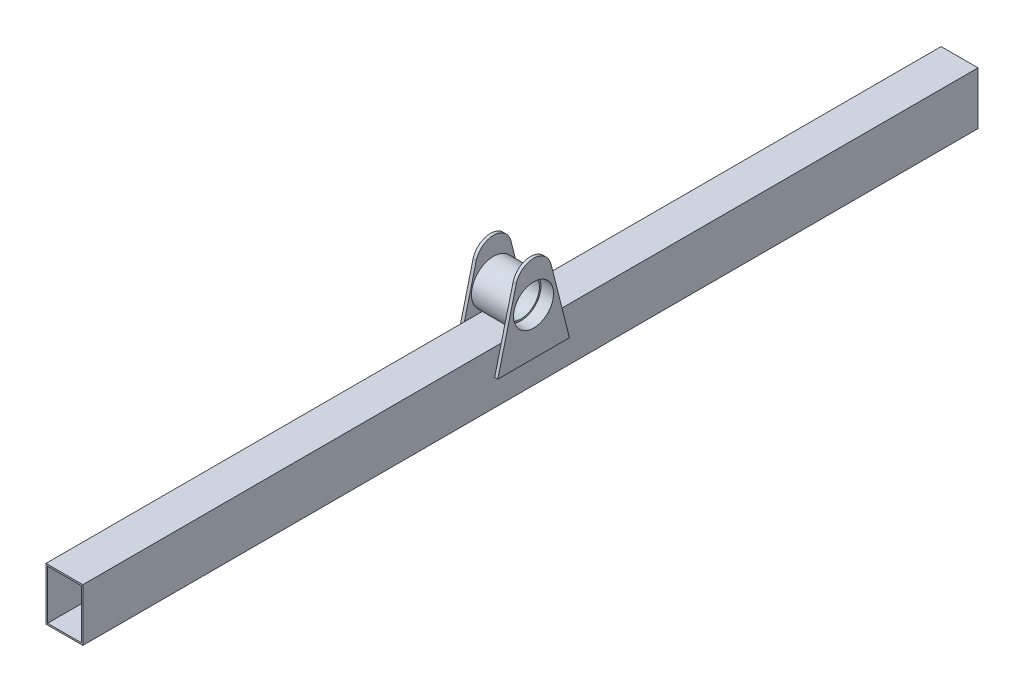
ISO-10303-21;
HEADER;
FILE_DESCRIPTION(('STEP AP214'),'2;1');
FILE_NAME('part.step','',(''),(''),'','','');
FILE_SCHEMA(('AUTOMOTIVE_DESIGN { 1 0 10303 214 1 1 1 1 }'));
ENDSEC;
DATA;
#1=APPLICATION_CONTEXT('core data for automotive mechanical design processes');
#2=APPLICATION_PROTOCOL_DEFINITION('international standard','automotive_design',2000,#1);
#3=PRODUCT_CONTEXT('',#1,'mechanical');
#4=PRODUCT('Part','Part','',(#3));
#5=PRODUCT_RELATED_PRODUCT_CATEGORY('part','',(#4));
#6=PRODUCT_DEFINITION_FORMATION('','',#4);
#7=PRODUCT_DEFINITION_CONTEXT('part definition',#1,'design');
#8=PRODUCT_DEFINITION('design','',#6,#7);
#9=PRODUCT_DEFINITION_SHAPE('','',#8);
#10=(LENGTH_UNIT() NAMED_UNIT(*) SI_UNIT(.MILLI.,.METRE.));
#11=(NAMED_UNIT(*) PLANE_ANGLE_UNIT() SI_UNIT($,.RADIAN.));
#12=(NAMED_UNIT(*) SI_UNIT($,.STERADIAN.) SOLID_ANGLE_UNIT());
#13=UNCERTAINTY_MEASURE_WITH_UNIT(LENGTH_MEASURE(1.E-05),#10,'distance_accuracy_value','');
#14=(GEOMETRIC_REPRESENTATION_CONTEXT(3) GLOBAL_UNCERTAINTY_ASSIGNED_CONTEXT((#13)) GLOBAL_UNIT_ASSIGNED_CONTEXT((#10,
#11,#12)) REPRESENTATION_CONTEXT('',''));
#15=CARTESIAN_POINT('',(0.,0.,0.));
#16=DIRECTION('',(0.,0.,1.));
#17=DIRECTION('',(1.,0.,0.));
#18=AXIS2_PLACEMENT_3D('',#15,#16,#17);
#19=CARTESIAN_POINT('',(76.89696961967,44.,35.));
#20=DIRECTION('',(-1.,0.,0.));
#21=DIRECTION('',(0.,-1.,0.));
#22=AXIS2_PLACEMENT_3D('',#19,#20,#21);
#23=CYLINDRICAL_SURFACE('',#22,17.5);
#24=CARTESIAN_POINT('',(8.50000000000001,44.,35.));
#25=DIRECTION('',(1.,0.,0.));
#26=DIRECTION('',(0.,1.,0.));
#27=AXIS2_PLACEMENT_3D('',#24,#25,#26);
#28=CIRCLE('',#27,17.5);
#29=CARTESIAN_POINT('',(8.50000000000001,61.5,35.));
#30=VERTEX_POINT('',#29);
#31=EDGE_CURVE('E256',#30,#30,#28,.T.);
#32=ORIENTED_EDGE('',*,*,#31,.T.);
#33=EDGE_LOOP('',(#32));
#34=FACE_BOUND('',#33,.T.);
#35=CARTESIAN_POINT('',(-8.50000000000001,44.,35.));
#36=DIRECTION('',(-1.,0.,0.));
#37=DIRECTION('',(0.,-1.,0.));
#38=AXIS2_PLACEMENT_3D('',#35,#36,#37);
#39=CIRCLE('',#38,17.5);
#40=CARTESIAN_POINT('',(-8.50000000000001,26.5,35.));
#41=VERTEX_POINT('',#40);
#42=EDGE_CURVE('E45',#41,#41,#39,.T.);
#43=ORIENTED_EDGE('',*,*,#42,.T.);
#44=EDGE_LOOP('',(#43));
#45=FACE_BOUND('',#44,.T.);
#46=ADVANCED_FACE('F41',(#34,#45),#23,.F.);
#47=CARTESIAN_POINT('',(-17.5,25.,460.));
#48=DIRECTION('',(0.,-1.,0.));
#49=DIRECTION('',(0.,0.,-1.));
#50=AXIS2_PLACEMENT_3D('',#47,#48,#49);
#51=PLANE('',#50);
#52=DIRECTION('',(-1.,0.,0.));
#53=VECTOR('',#52,1.);
#54=CARTESIAN_POINT('',(76.89696961967,25.,43.9442719099991));
#55=LINE('',#54,#53);
#56=CARTESIAN_POINT('',(-17.5,25.,43.9442719099991));
#57=VERTEX_POINT('',#56);
#58=CARTESIAN_POINT('',(17.5,25.,43.9442719099991));
#59=VERTEX_POINT('',#58);
#60=EDGE_CURVE('E68',#57,#59,#55,.F.);
#61=ORIENTED_EDGE('',*,*,#60,.F.);
#62=DIRECTION('',(0.,0.,-1.));
#63=VECTOR('',#62,1.);
#64=CARTESIAN_POINT('',(-17.5,25.,460.));
#65=LINE('',#64,#63);
#66=CARTESIAN_POINT('',(-17.5,25.,62.7038895343666));
#67=VERTEX_POINT('',#66);
#68=EDGE_CURVE('E424',#67,#57,#65,.T.);
#69=ORIENTED_EDGE('',*,*,#68,.F.);
#70=CARTESIAN_POINT('',(-17.5,25.,460.));
#71=VERTEX_POINT('',#70);
#72=EDGE_CURVE('E420',#71,#67,#65,.T.);
#73=ORIENTED_EDGE('',*,*,#72,.F.);
#74=DIRECTION('',(-1.,0.,0.));
#75=VECTOR('',#74,1.);
#76=CARTESIAN_POINT('',(-17.5,25.,460.));
#77=LINE('',#76,#75);
#78=CARTESIAN_POINT('',(17.5,25.,460.));
#79=VERTEX_POINT('',#78);
#80=EDGE_CURVE('E404',#79,#71,#77,.T.);
#81=ORIENTED_EDGE('',*,*,#80,.F.);
#82=DIRECTION('',(0.,0.,-1.));
#83=VECTOR('',#82,1.);
#84=CARTESIAN_POINT('',(17.5,25.,460.));
#85=LINE('',#84,#83);
#86=CARTESIAN_POINT('',(17.5,25.,62.7038895343666));
#87=VERTEX_POINT('',#86);
#88=EDGE_CURVE('E426',#79,#87,#85,.T.);
#89=ORIENTED_EDGE('',*,*,#88,.T.);
#90=EDGE_CURVE('E429',#87,#59,#85,.T.);
#91=ORIENTED_EDGE('',*,*,#90,.T.);
#92=EDGE_LOOP('',(#61,#69,#73,#81,#89,#91));
#93=FACE_BOUND('',#92,.T.);
#94=ADVANCED_FACE('F462',(#93),#51,.F.);
#95=DIRECTION('',(-1.,0.,0.));
#96=VECTOR('',#95,1.);
#97=CARTESIAN_POINT('',(76.89696961967,25.,26.0557280900009));
#98=LINE('',#97,#96);
#99=CARTESIAN_POINT('',(17.5,25.,26.0557280900009));
#100=VERTEX_POINT('',#99);
#101=CARTESIAN_POINT('',(-17.5,25.,26.0557280900009));
#102=VERTEX_POINT('',#101);
#103=EDGE_CURVE('E273',#100,#102,#98,.T.);
#104=ORIENTED_EDGE('',*,*,#103,.F.);
#105=CARTESIAN_POINT('',(17.5,25.,7.29611046563342));
#106=VERTEX_POINT('',#105);
#107=EDGE_CURVE('E430',#100,#106,#85,.T.);
#108=ORIENTED_EDGE('',*,*,#107,.T.);
#109=CARTESIAN_POINT('',(17.5,25.,-390.));
#110=VERTEX_POINT('',#109);
#111=EDGE_CURVE('E423',#106,#110,#85,.T.);
#112=ORIENTED_EDGE('',*,*,#111,.T.);
#113=DIRECTION('',(-1.,0.,0.));
#114=VECTOR('',#113,1.);
#115=CARTESIAN_POINT('',(-17.5,25.,-390.));
#116=LINE('',#115,#114);
#117=CARTESIAN_POINT('',(-17.5,25.,-390.));
#118=VERTEX_POINT('',#117);
#119=EDGE_CURVE('E236',#110,#118,#116,.T.);
#120=ORIENTED_EDGE('',*,*,#119,.T.);
#121=CARTESIAN_POINT('',(-17.5,25.,7.29611046563346));
#122=VERTEX_POINT('',#121);
#123=EDGE_CURVE('E419',#122,#118,#65,.T.);
#124=ORIENTED_EDGE('',*,*,#123,.F.);
#125=EDGE_CURVE('E425',#102,#122,#65,.T.);
#126=ORIENTED_EDGE('',*,*,#125,.F.);
#127=EDGE_LOOP('',(#104,#108,#112,#120,#124,#126));
#128=FACE_BOUND('',#127,.T.);
#129=ADVANCED_FACE('F466',(#128),#51,.F.);
#130=CARTESIAN_POINT('',(-16.,23.5,460.));
#131=DIRECTION('',(0.,-1.,0.));
#132=DIRECTION('',(0.,0.,-1.));
#133=AXIS2_PLACEMENT_3D('',#130,#131,#132);
#134=PLANE('',#133);
#135=DIRECTION('',(0.,0.,-1.));
#136=VECTOR('',#135,1.);
#137=CARTESIAN_POINT('',(-16.,23.5,460.));
#138=LINE('',#137,#136);
#139=CARTESIAN_POINT('',(-16.,23.5,460.));
#140=VERTEX_POINT('',#139);
#141=CARTESIAN_POINT('',(-16.,23.5,39.5552167895721));
#142=VERTEX_POINT('',#141);
#143=EDGE_CURVE('E208',#140,#142,#138,.T.);
#144=ORIENTED_EDGE('',*,*,#143,.T.);
#145=DIRECTION('',(-1.,0.,0.));
#146=VECTOR('',#145,1.);
#147=CARTESIAN_POINT('',(76.89696961967,23.5,39.5552167895721));
#148=LINE('',#147,#146);
#149=CARTESIAN_POINT('',(16.,23.5,39.5552167895721));
#150=VERTEX_POINT('',#149);
#151=EDGE_CURVE('E60',#142,#150,#148,.F.);
#152=ORIENTED_EDGE('',*,*,#151,.T.);
#153=DIRECTION('',(0.,0.,-1.));
#154=VECTOR('',#153,1.);
#155=CARTESIAN_POINT('',(16.,23.5,460.));
#156=LINE('',#155,#154);
#157=CARTESIAN_POINT('',(16.,23.5,460.));
#158=VERTEX_POINT('',#157);
#159=EDGE_CURVE('E207',#158,#150,#156,.T.);
#160=ORIENTED_EDGE('',*,*,#159,.F.);
#161=DIRECTION('',(-1.,0.,0.));
#162=VECTOR('',#161,1.);
#163=CARTESIAN_POINT('',(-16.,23.5,460.));
#164=LINE('',#163,#162);
#165=EDGE_CURVE('E380',#158,#140,#164,.T.);
#166=ORIENTED_EDGE('',*,*,#165,.T.);
#167=EDGE_LOOP('',(#144,#152,#160,#166));
#168=FACE_BOUND('',#167,.T.);
#169=ADVANCED_FACE('F530',(#168),#134,.T.);
#170=CARTESIAN_POINT('',(16.,23.5,30.4447832104279));
#171=VERTEX_POINT('',#170);
#172=CARTESIAN_POINT('',(16.,23.5,-390.));
#173=VERTEX_POINT('',#172);
#174=EDGE_CURVE('E195',#171,#173,#156,.T.);
#175=ORIENTED_EDGE('',*,*,#174,.F.);
#176=DIRECTION('',(-1.,0.,0.));
#177=VECTOR('',#176,1.);
#178=CARTESIAN_POINT('',(76.89696961967,23.5,30.4447832104279));
#179=LINE('',#178,#177);
#180=CARTESIAN_POINT('',(-16.,23.5,30.4447832104279));
#181=VERTEX_POINT('',#180);
#182=EDGE_CURVE('E266',#171,#181,#179,.T.);
#183=ORIENTED_EDGE('',*,*,#182,.T.);
#184=CARTESIAN_POINT('',(-16.,23.5,-390.));
#185=VERTEX_POINT('',#184);
#186=EDGE_CURVE('E214',#181,#185,#138,.T.);
#187=ORIENTED_EDGE('',*,*,#186,.T.);
#188=DIRECTION('',(-1.,0.,0.));
#189=VECTOR('',#188,1.);
#190=CARTESIAN_POINT('',(-16.,23.5,-390.));
#191=LINE('',#190,#189);
#192=EDGE_CURVE('E211',#173,#185,#191,.T.);
#193=ORIENTED_EDGE('',*,*,#192,.F.);
#194=EDGE_LOOP('',(#175,#183,#187,#193));
#195=FACE_BOUND('',#194,.T.);
#196=ADVANCED_FACE('F212',(#195),#134,.T.);
#197=CARTESIAN_POINT('',(-17.5,25.,460.));
#198=DIRECTION('',(1.,0.,0.));
#199=DIRECTION('',(0.,1.,0.));
#200=AXIS2_PLACEMENT_3D('',#197,#198,#199);
#201=PLANE('',#200);
#202=DIRECTION('',(0.,-0.969720199688775,-0.244218619919864));
#203=VECTOR('',#202,1.);
#204=CARTESIAN_POINT('',(-17.5,0.,1.00000000000003));
#205=LINE('',#204,#203);
#206=CARTESIAN_POINT('',(-17.5,0.,1.00000000000003));
#207=VERTEX_POINT('',#206);
#208=EDGE_CURVE('E51',#122,#207,#205,.T.);
#209=ORIENTED_EDGE('',*,*,#208,.F.);
#210=ORIENTED_EDGE('',*,*,#123,.T.);
#211=DIRECTION('',(0.,-1.,0.));
#212=VECTOR('',#211,1.);
#213=CARTESIAN_POINT('',(-17.5,25.,-390.));
#214=LINE('',#213,#212);
#215=CARTESIAN_POINT('',(-17.5,-25.,-390.));
#216=VERTEX_POINT('',#215);
#217=EDGE_CURVE('E240',#118,#216,#214,.T.);
#218=ORIENTED_EDGE('',*,*,#217,.T.);
#219=DIRECTION('',(0.,0.,-1.));
#220=VECTOR('',#219,1.);
#221=CARTESIAN_POINT('',(-17.5,-25.,460.));
#222=LINE('',#221,#220);
#223=CARTESIAN_POINT('',(-17.5,-25.,460.));
#224=VERTEX_POINT('',#223);
#225=EDGE_CURVE('E416',#224,#216,#222,.T.);
#226=ORIENTED_EDGE('',*,*,#225,.F.);
#227=DIRECTION('',(0.,-1.,0.));
#228=VECTOR('',#227,1.);
#229=CARTESIAN_POINT('',(-17.5,25.,460.));
#230=LINE('',#229,#228);
#231=EDGE_CURVE('E407',#71,#224,#230,.T.);
#232=ORIENTED_EDGE('',*,*,#231,.F.);
#233=ORIENTED_EDGE('',*,*,#72,.T.);
#234=DIRECTION('',(0.,0.969720199688775,-0.244218619919864));
#235=VECTOR('',#234,1.);
#236=CARTESIAN_POINT('',(-17.5,25.,62.7038895343666));
#237=LINE('',#236,#235);
#238=CARTESIAN_POINT('',(-17.5,0.,69.));
#239=VERTEX_POINT('',#238);
#240=EDGE_CURVE('E351',#239,#67,#237,.T.);
#241=ORIENTED_EDGE('',*,*,#240,.F.);
#242=DIRECTION('',(0.,0.,1.));
#243=VECTOR('',#242,1.);
#244=CARTESIAN_POINT('',(-17.5,0.,1.00000000000003));
#245=LINE('',#244,#243);
#246=EDGE_CURVE('E331',#207,#239,#245,.T.);
#247=ORIENTED_EDGE('',*,*,#246,.F.);
#248=EDGE_LOOP('',(#209,#210,#218,#226,#232,#233,#241,#247));
#249=FACE_BOUND('',#248,.T.);
#250=ADVANCED_FACE('F650',(#249),#201,.F.);
#251=CARTESIAN_POINT('',(0.,0.,460.));
#252=DIRECTION('',(0.,0.,1.));
#253=DIRECTION('',(1.,0.,0.));
#254=AXIS2_PLACEMENT_3D('',#251,#252,#253);
#255=PLANE('',#254);
#256=DIRECTION('',(0.,1.,0.));
#257=VECTOR('',#256,1.);
#258=CARTESIAN_POINT('',(17.5,25.,460.));
#259=LINE('',#258,#257);
#260=CARTESIAN_POINT('',(17.5,-25.,460.));
#261=VERTEX_POINT('',#260);
#262=EDGE_CURVE('E400',#261,#79,#259,.T.);
#263=ORIENTED_EDGE('',*,*,#262,.T.);
#264=ORIENTED_EDGE('',*,*,#80,.T.);
#265=ORIENTED_EDGE('',*,*,#231,.T.);
#266=DIRECTION('',(1.,0.,0.));
#267=VECTOR('',#266,1.);
#268=CARTESIAN_POINT('',(-17.5,-25.,460.));
#269=LINE('',#268,#267);
#270=EDGE_CURVE('E410',#224,#261,#269,.T.);
#271=ORIENTED_EDGE('',*,*,#270,.T.);
#272=EDGE_LOOP('',(#263,#264,#265,#271));
#273=FACE_BOUND('',#272,.T.);
#274=ORIENTED_EDGE('',*,*,#165,.F.);
#275=DIRECTION('',(0.,1.,0.));
#276=VECTOR('',#275,1.);
#277=CARTESIAN_POINT('',(16.,23.5,460.));
#278=LINE('',#277,#276);
#279=CARTESIAN_POINT('',(16.,-23.5,460.));
#280=VERTEX_POINT('',#279);
#281=EDGE_CURVE('E377',#280,#158,#278,.T.);
#282=ORIENTED_EDGE('',*,*,#281,.F.);
#283=DIRECTION('',(1.,0.,0.));
#284=VECTOR('',#283,1.);
#285=CARTESIAN_POINT('',(-16.,-23.5,460.));
#286=LINE('',#285,#284);
#287=CARTESIAN_POINT('',(-16.,-23.5,460.));
#288=VERTEX_POINT('',#287);
#289=EDGE_CURVE('E387',#288,#280,#286,.T.);
#290=ORIENTED_EDGE('',*,*,#289,.F.);
#291=DIRECTION('',(0.,-1.,0.));
#292=VECTOR('',#291,1.);
#293=CARTESIAN_POINT('',(-16.,23.5,460.));
#294=LINE('',#293,#292);
#295=EDGE_CURVE('E383',#140,#288,#294,.T.);
#296=ORIENTED_EDGE('',*,*,#295,.F.);
#297=EDGE_LOOP('',(#274,#282,#290,#296));
#298=FACE_BOUND('',#297,.T.);
#299=ADVANCED_FACE('F646',(#273,#298),#255,.T.);
#300=CARTESIAN_POINT('',(17.5,25.,460.));
#301=DIRECTION('',(-1.,0.,0.));
#302=DIRECTION('',(0.,-1.,0.));
#303=AXIS2_PLACEMENT_3D('',#300,#301,#302);
#304=PLANE('',#303);
#305=DIRECTION('',(0.,0.,1.));
#306=VECTOR('',#305,1.);
#307=CARTESIAN_POINT('',(17.5,0.,1.00000000000003));
#308=LINE('',#307,#306);
#309=CARTESIAN_POINT('',(17.5,0.,1.00000000000003));
#310=VERTEX_POINT('',#309);
#311=CARTESIAN_POINT('',(17.5,0.,69.));
#312=VERTEX_POINT('',#311);
#313=EDGE_CURVE('E282',#310,#312,#308,.T.);
#314=ORIENTED_EDGE('',*,*,#313,.T.);
#315=DIRECTION('',(0.,0.969720199688775,-0.244218619919864));
#316=VECTOR('',#315,1.);
#317=CARTESIAN_POINT('',(17.5,0.,69.));
#318=LINE('',#317,#316);
#319=EDGE_CURVE('E288',#312,#87,#318,.T.);
#320=ORIENTED_EDGE('',*,*,#319,.T.);
#321=ORIENTED_EDGE('',*,*,#88,.F.);
#322=ORIENTED_EDGE('',*,*,#262,.F.);
#323=DIRECTION('',(0.,0.,-1.));
#324=VECTOR('',#323,1.);
#325=CARTESIAN_POINT('',(17.5,-25.,460.));
#326=LINE('',#325,#324);
#327=CARTESIAN_POINT('',(17.5,-25.,-390.));
#328=VERTEX_POINT('',#327);
#329=EDGE_CURVE('E413',#261,#328,#326,.T.);
#330=ORIENTED_EDGE('',*,*,#329,.T.);
#331=DIRECTION('',(0.,1.,0.));
#332=VECTOR('',#331,1.);
#333=CARTESIAN_POINT('',(17.5,25.,-390.));
#334=LINE('',#333,#332);
#335=EDGE_CURVE('E232',#328,#110,#334,.T.);
#336=ORIENTED_EDGE('',*,*,#335,.T.);
#337=ORIENTED_EDGE('',*,*,#111,.F.);
#338=DIRECTION('',(0.,-0.969720199688775,-0.244218619919864));
#339=VECTOR('',#338,1.);
#340=CARTESIAN_POINT('',(17.5,25.,7.29611046563342));
#341=LINE('',#340,#339);
#342=EDGE_CURVE('E11',#106,#310,#341,.T.);
#343=ORIENTED_EDGE('',*,*,#342,.T.);
#344=EDGE_LOOP('',(#314,#320,#321,#322,#330,#336,#337,#343));
#345=FACE_BOUND('',#344,.T.);
#346=ADVANCED_FACE('F43',(#345),#304,.F.);
#347=CARTESIAN_POINT('',(-17.5,-25.,460.));
#348=DIRECTION('',(0.,1.,0.));
#349=DIRECTION('',(0.,0.,1.));
#350=AXIS2_PLACEMENT_3D('',#347,#348,#349);
#351=PLANE('',#350);
#352=ORIENTED_EDGE('',*,*,#225,.T.);
#353=DIRECTION('',(1.,0.,0.));
#354=VECTOR('',#353,1.);
#355=CARTESIAN_POINT('',(-17.5,-25.,-390.));
#356=LINE('',#355,#354);
#357=EDGE_CURVE('E244',#216,#328,#356,.T.);
#358=ORIENTED_EDGE('',*,*,#357,.T.);
#359=ORIENTED_EDGE('',*,*,#329,.F.);
#360=ORIENTED_EDGE('',*,*,#270,.F.);
#361=EDGE_LOOP('',(#352,#358,#359,#360));
#362=FACE_BOUND('',#361,.T.);
#363=ADVANCED_FACE('F664',(#362),#351,.F.);
#364=CARTESIAN_POINT('',(16.,23.5,460.));
#365=DIRECTION('',(-1.,0.,0.));
#366=DIRECTION('',(0.,-1.,0.));
#367=AXIS2_PLACEMENT_3D('',#364,#365,#366);
#368=PLANE('',#367);
#369=ORIENTED_EDGE('',*,*,#159,.T.);
#370=CARTESIAN_POINT('',(16.,44.,35.));
#371=DIRECTION('',(-1.,0.,0.));
#372=DIRECTION('',(0.,-1.,0.));
#373=AXIS2_PLACEMENT_3D('',#370,#371,#372);
#374=CIRCLE('',#373,21.);
#375=EDGE_CURVE('E203',#150,#171,#374,.F.);
#376=ORIENTED_EDGE('',*,*,#375,.T.);
#377=ORIENTED_EDGE('',*,*,#174,.T.);
#378=DIRECTION('',(0.,1.,0.));
#379=VECTOR('',#378,1.);
#380=CARTESIAN_POINT('',(16.,23.5,-390.));
#381=LINE('',#380,#379);
#382=CARTESIAN_POINT('',(16.,-23.5,-390.));
#383=VERTEX_POINT('',#382);
#384=EDGE_CURVE('E201',#383,#173,#381,.T.);
#385=ORIENTED_EDGE('',*,*,#384,.F.);
#386=DIRECTION('',(0.,0.,-1.));
#387=VECTOR('',#386,1.);
#388=CARTESIAN_POINT('',(16.,-23.5,460.));
#389=LINE('',#388,#387);
#390=EDGE_CURVE('E390',#280,#383,#389,.T.);
#391=ORIENTED_EDGE('',*,*,#390,.F.);
#392=ORIENTED_EDGE('',*,*,#281,.T.);
#393=EDGE_LOOP('',(#369,#376,#377,#385,#391,#392));
#394=FACE_BOUND('',#393,.T.);
#395=ADVANCED_FACE('F198',(#394),#368,.T.);
#396=CARTESIAN_POINT('',(-16.,23.5,460.));
#397=DIRECTION('',(1.,0.,0.));
#398=DIRECTION('',(0.,1.,0.));
#399=AXIS2_PLACEMENT_3D('',#396,#397,#398);
#400=PLANE('',#399);
#401=ORIENTED_EDGE('',*,*,#186,.F.);
#402=CARTESIAN_POINT('',(-16.,44.,35.));
#403=DIRECTION('',(1.,0.,0.));
#404=DIRECTION('',(0.,1.,0.));
#405=AXIS2_PLACEMENT_3D('',#402,#403,#404);
#406=CIRCLE('',#405,21.);
#407=EDGE_CURVE('E260',#181,#142,#406,.F.);
#408=ORIENTED_EDGE('',*,*,#407,.T.);
#409=ORIENTED_EDGE('',*,*,#143,.F.);
#410=ORIENTED_EDGE('',*,*,#295,.T.);
#411=DIRECTION('',(0.,0.,-1.));
#412=VECTOR('',#411,1.);
#413=CARTESIAN_POINT('',(-16.,-23.5,460.));
#414=LINE('',#413,#412);
#415=CARTESIAN_POINT('',(-16.,-23.5,-390.));
#416=VERTEX_POINT('',#415);
#417=EDGE_CURVE('E393',#288,#416,#414,.T.);
#418=ORIENTED_EDGE('',*,*,#417,.T.);
#419=DIRECTION('',(0.,-1.,0.));
#420=VECTOR('',#419,1.);
#421=CARTESIAN_POINT('',(-16.,23.5,-390.));
#422=LINE('',#421,#420);
#423=EDGE_CURVE('E219',#185,#416,#422,.T.);
#424=ORIENTED_EDGE('',*,*,#423,.F.);
#425=EDGE_LOOP('',(#401,#408,#409,#410,#418,#424));
#426=FACE_BOUND('',#425,.T.);
#427=ADVANCED_FACE('F678',(#426),#400,.T.);
#428=CARTESIAN_POINT('',(-16.,-23.5,460.));
#429=DIRECTION('',(0.,1.,0.));
#430=DIRECTION('',(0.,0.,1.));
#431=AXIS2_PLACEMENT_3D('',#428,#429,#430);
#432=PLANE('',#431);
#433=ORIENTED_EDGE('',*,*,#390,.T.);
#434=DIRECTION('',(1.,0.,0.));
#435=VECTOR('',#434,1.);
#436=CARTESIAN_POINT('',(-16.,-23.5,-390.));
#437=LINE('',#436,#435);
#438=EDGE_CURVE('E224',#416,#383,#437,.T.);
#439=ORIENTED_EDGE('',*,*,#438,.F.);
#440=ORIENTED_EDGE('',*,*,#417,.F.);
#441=ORIENTED_EDGE('',*,*,#289,.T.);
#442=EDGE_LOOP('',(#433,#439,#440,#441));
#443=FACE_BOUND('',#442,.T.);
#444=ADVANCED_FACE('F638',(#443),#432,.T.);
#445=CARTESIAN_POINT('',(-20.5,0.,1.00000000000003));
#446=DIRECTION('',(0.,1.,0.));
#447=DIRECTION('',(-1.,0.,0.));
#448=AXIS2_PLACEMENT_3D('',#445,#446,#447);
#449=PLANE('',#448);
#450=ORIENTED_EDGE('',*,*,#246,.T.);
#451=DIRECTION('',(1.,0.,0.));
#452=VECTOR('',#451,1.);
#453=CARTESIAN_POINT('',(-20.5,0.,69.));
#454=LINE('',#453,#452);
#455=CARTESIAN_POINT('',(-20.5,0.,69.));
#456=VERTEX_POINT('',#455);
#457=EDGE_CURVE('E373',#456,#239,#454,.T.);
#458=ORIENTED_EDGE('',*,*,#457,.F.);
#459=DIRECTION('',(0.,0.,1.));
#460=VECTOR('',#459,1.);
#461=CARTESIAN_POINT('',(-20.5,0.,1.00000000000003));
#462=LINE('',#461,#460);
#463=CARTESIAN_POINT('',(-20.5,0.,1.00000000000003));
#464=VERTEX_POINT('',#463);
#465=EDGE_CURVE('E332',#464,#456,#462,.T.);
#466=ORIENTED_EDGE('',*,*,#465,.F.);
#467=DIRECTION('',(1.,0.,0.));
#468=VECTOR('',#467,1.);
#469=CARTESIAN_POINT('',(-20.5,0.,1.00000000000003));
#470=LINE('',#469,#468);
#471=EDGE_CURVE('E346',#464,#207,#470,.T.);
#472=ORIENTED_EDGE('',*,*,#471,.T.);
#473=EDGE_LOOP('',(#450,#458,#466,#472));
#474=FACE_BOUND('',#473,.T.);
#475=ADVANCED_FACE('F627',(#474),#449,.F.);
#476=CARTESIAN_POINT('',(-20.5,25.,62.7038895343666));
#477=DIRECTION('',(0.,-0.244218619919864,-0.969720199688775));
#478=DIRECTION('',(0.,0.969720199688775,-0.244218619919864));
#479=AXIS2_PLACEMENT_3D('',#476,#477,#478);
#480=PLANE('',#479);
#481=ORIENTED_EDGE('',*,*,#240,.T.);
#482=CARTESIAN_POINT('',(-17.5,69.4873449867254,51.5));
#483=VERTEX_POINT('',#482);
#484=EDGE_CURVE('E350',#67,#483,#237,.T.);
#485=ORIENTED_EDGE('',*,*,#484,.T.);
#486=DIRECTION('',(1.,0.,0.));
#487=VECTOR('',#486,1.);
#488=CARTESIAN_POINT('',(-20.5,69.4873449867254,51.5));
#489=LINE('',#488,#487);
#490=CARTESIAN_POINT('',(-20.5,69.4873449867254,51.5));
#491=VERTEX_POINT('',#490);
#492=EDGE_CURVE('E369',#491,#483,#489,.T.);
#493=ORIENTED_EDGE('',*,*,#492,.F.);
#494=DIRECTION('',(0.,0.969720199688775,-0.244218619919864));
#495=VECTOR('',#494,1.);
#496=CARTESIAN_POINT('',(-20.5,0.,69.));
#497=LINE('',#496,#495);
#498=EDGE_CURVE('E336',#456,#491,#497,.T.);
#499=ORIENTED_EDGE('',*,*,#498,.F.);
#500=ORIENTED_EDGE('',*,*,#457,.T.);
#501=EDGE_LOOP('',(#481,#485,#493,#499,#500));
#502=FACE_BOUND('',#501,.T.);
#503=ADVANCED_FACE('F617',(#502),#480,.F.);
#504=CARTESIAN_POINT('',(-20.5,65.3319120794074,35.));
#505=DIRECTION('',(1.,0.,0.));
#506=DIRECTION('',(0.,1.,0.));
#507=AXIS2_PLACEMENT_3D('',#504,#505,#506);
#508=CYLINDRICAL_SURFACE('',#507,17.0152173846596);
#509=CARTESIAN_POINT('',(-17.5,65.3319120794074,35.));
#510=DIRECTION('',(-1.,0.,0.));
#511=DIRECTION('',(0.,1.,0.));
#512=AXIS2_PLACEMENT_3D('',#509,#510,#511);
#513=CIRCLE('',#512,17.0152173846596);
#514=CARTESIAN_POINT('',(-17.5,69.4873449867254,18.5));
#515=VERTEX_POINT('',#514);
#516=EDGE_CURVE('E355',#483,#515,#513,.T.);
#517=ORIENTED_EDGE('',*,*,#516,.T.);
#518=DIRECTION('',(1.,0.,0.));
#519=VECTOR('',#518,1.);
#520=CARTESIAN_POINT('',(-20.5,69.4873449867254,18.5));
#521=LINE('',#520,#519);
#522=CARTESIAN_POINT('',(-20.5,69.4873449867254,18.5));
#523=VERTEX_POINT('',#522);
#524=EDGE_CURVE('E365',#523,#515,#521,.T.);
#525=ORIENTED_EDGE('',*,*,#524,.F.);
#526=CARTESIAN_POINT('',(-20.5,65.3319120794074,35.));
#527=DIRECTION('',(-1.,0.,0.));
#528=DIRECTION('',(0.,1.,0.));
#529=AXIS2_PLACEMENT_3D('',#526,#527,#528);
#530=CIRCLE('',#529,17.0152173846596);
#531=EDGE_CURVE('E340',#491,#523,#530,.T.);
#532=ORIENTED_EDGE('',*,*,#531,.F.);
#533=ORIENTED_EDGE('',*,*,#492,.T.);
#534=EDGE_LOOP('',(#517,#525,#532,#533));
#535=FACE_BOUND('',#534,.T.);
#536=ADVANCED_FACE('F606',(#535),#508,.T.);
#537=CARTESIAN_POINT('',(-20.5,0.,1.00000000000003));
#538=DIRECTION('',(0.,-0.244218619919864,0.969720199688775));
#539=DIRECTION('',(0.,-0.969720199688775,-0.244218619919864));
#540=AXIS2_PLACEMENT_3D('',#537,#538,#539);
#541=PLANE('',#540);
#542=EDGE_CURVE('E337',#515,#122,#205,.T.);
#543=ORIENTED_EDGE('',*,*,#542,.T.);
#544=ORIENTED_EDGE('',*,*,#208,.T.);
#545=ORIENTED_EDGE('',*,*,#471,.F.);
#546=DIRECTION('',(0.,-0.969720199688775,-0.244218619919864));
#547=VECTOR('',#546,1.);
#548=CARTESIAN_POINT('',(-20.5,25.,7.29611046563342));
#549=LINE('',#548,#547);
#550=EDGE_CURVE('E343',#523,#464,#549,.T.);
#551=ORIENTED_EDGE('',*,*,#550,.F.);
#552=ORIENTED_EDGE('',*,*,#524,.T.);
#553=EDGE_LOOP('',(#543,#544,#545,#551,#552));
#554=FACE_BOUND('',#553,.T.);
#555=ADVANCED_FACE('F596',(#554),#541,.F.);
#556=CARTESIAN_POINT('',(-20.5,65.3319120794074,35.));
#557=DIRECTION('',(1.,0.,0.));
#558=DIRECTION('',(0.,1.,0.));
#559=AXIS2_PLACEMENT_3D('',#556,#557,#558);
#560=PLANE('',#559);
#561=CARTESIAN_POINT('',(-20.5,44.,35.));
#562=DIRECTION('',(-1.,0.,0.));
#563=DIRECTION('',(0.,-1.,0.));
#564=AXIS2_PLACEMENT_3D('',#561,#562,#563);
#565=CIRCLE('',#564,19.);
#566=CARTESIAN_POINT('',(-20.5,25.,35.));
#567=VERTEX_POINT('',#566);
#568=EDGE_CURVE('E327',#567,#567,#565,.T.);
#569=ORIENTED_EDGE('',*,*,#568,.F.);
#570=EDGE_LOOP('',(#569));
#571=FACE_BOUND('',#570,.T.);
#572=ORIENTED_EDGE('',*,*,#465,.T.);
#573=ORIENTED_EDGE('',*,*,#498,.T.);
#574=ORIENTED_EDGE('',*,*,#531,.T.);
#575=ORIENTED_EDGE('',*,*,#550,.T.);
#576=EDGE_LOOP('',(#572,#573,#574,#575));
#577=FACE_BOUND('',#576,.T.);
#578=ADVANCED_FACE('F522',(#571,#577),#560,.F.);
#579=CARTESIAN_POINT('',(-17.5,65.3319120794074,35.));
#580=DIRECTION('',(1.,0.,0.));
#581=DIRECTION('',(0.,1.,0.));
#582=AXIS2_PLACEMENT_3D('',#579,#580,#581);
#583=PLANE('',#582);
#584=ORIENTED_EDGE('',*,*,#68,.T.);
#585=CARTESIAN_POINT('',(-17.5,44.,35.));
#586=DIRECTION('',(1.,0.,0.));
#587=DIRECTION('',(0.,1.,0.));
#588=AXIS2_PLACEMENT_3D('',#585,#586,#587);
#589=CIRCLE('',#588,21.);
#590=EDGE_CURVE('E257',#102,#57,#589,.T.);
#591=ORIENTED_EDGE('',*,*,#590,.F.);
#592=ORIENTED_EDGE('',*,*,#125,.T.);
#593=ORIENTED_EDGE('',*,*,#542,.F.);
#594=ORIENTED_EDGE('',*,*,#516,.F.);
#595=ORIENTED_EDGE('',*,*,#484,.F.);
#596=EDGE_LOOP('',(#584,#591,#592,#593,#594,#595));
#597=FACE_BOUND('',#596,.T.);
#598=ADVANCED_FACE('F517',(#597),#583,.T.);
#599=CARTESIAN_POINT('',(-17.5,44.,35.));
#600=DIRECTION('',(-1.,0.,0.));
#601=DIRECTION('',(0.,-1.,0.));
#602=AXIS2_PLACEMENT_3D('',#599,#600,#601);
#603=CYLINDRICAL_SURFACE('',#602,19.);
#604=ORIENTED_EDGE('',*,*,#568,.T.);
#605=EDGE_LOOP('',(#604));
#606=FACE_BOUND('',#605,.T.);
#607=CARTESIAN_POINT('',(-8.50000000000001,44.,35.));
#608=DIRECTION('',(1.,0.,0.));
#609=DIRECTION('',(0.,1.,0.));
#610=AXIS2_PLACEMENT_3D('',#607,#608,#609);
#611=CIRCLE('',#610,19.);
#612=CARTESIAN_POINT('',(-8.50000000000001,63.,35.));
#613=VERTEX_POINT('',#612);
#614=EDGE_CURVE('E248',#613,#613,#611,.T.);
#615=ORIENTED_EDGE('',*,*,#614,.T.);
#616=EDGE_LOOP('',(#615));
#617=FACE_BOUND('',#616,.T.);
#618=ADVANCED_FACE('F507',(#606,#617),#603,.F.);
#619=CARTESIAN_POINT('',(17.5,65.3319120794074,35.));
#620=DIRECTION('',(-1.,0.,0.));
#621=DIRECTION('',(0.,1.,0.));
#622=AXIS2_PLACEMENT_3D('',#619,#620,#621);
#623=PLANE('',#622);
#624=ORIENTED_EDGE('',*,*,#107,.F.);
#625=CARTESIAN_POINT('',(17.5,44.,35.));
#626=DIRECTION('',(-1.,0.,0.));
#627=DIRECTION('',(0.,-1.,0.));
#628=AXIS2_PLACEMENT_3D('',#625,#626,#627);
#629=CIRCLE('',#628,21.);
#630=EDGE_CURVE('E261',#59,#100,#629,.T.);
#631=ORIENTED_EDGE('',*,*,#630,.F.);
#632=ORIENTED_EDGE('',*,*,#90,.F.);
#633=CARTESIAN_POINT('',(17.5,69.4873449867254,51.5));
#634=VERTEX_POINT('',#633);
#635=EDGE_CURVE('E310',#87,#634,#318,.T.);
#636=ORIENTED_EDGE('',*,*,#635,.T.);
#637=CARTESIAN_POINT('',(17.5,65.3319120794074,35.));
#638=DIRECTION('',(-1.,0.,0.));
#639=DIRECTION('',(0.,1.,0.));
#640=AXIS2_PLACEMENT_3D('',#637,#638,#639);
#641=CIRCLE('',#640,17.0152173846596);
#642=CARTESIAN_POINT('',(17.5,69.4873449867254,18.5));
#643=VERTEX_POINT('',#642);
#644=EDGE_CURVE('E306',#634,#643,#641,.T.);
#645=ORIENTED_EDGE('',*,*,#644,.T.);
#646=EDGE_CURVE('E53',#643,#106,#341,.T.);
#647=ORIENTED_EDGE('',*,*,#646,.T.);
#648=EDGE_LOOP('',(#624,#631,#632,#636,#645,#647));
#649=FACE_BOUND('',#648,.T.);
#650=ADVANCED_FACE('F501',(#649),#623,.T.);
#651=CARTESIAN_POINT('',(20.5,0.,1.00000000000003));
#652=DIRECTION('',(0.,-1.,0.));
#653=DIRECTION('',(1.,0.,0.));
#654=AXIS2_PLACEMENT_3D('',#651,#652,#653);
#655=PLANE('',#654);
#656=ORIENTED_EDGE('',*,*,#313,.F.);
#657=DIRECTION('',(-1.,0.,0.));
#658=VECTOR('',#657,1.);
#659=CARTESIAN_POINT('',(20.5,0.,1.00000000000003));
#660=LINE('',#659,#658);
#661=CARTESIAN_POINT('',(20.5,0.,1.00000000000003));
#662=VERTEX_POINT('',#661);
#663=EDGE_CURVE('E323',#662,#310,#660,.T.);
#664=ORIENTED_EDGE('',*,*,#663,.F.);
#665=DIRECTION('',(0.,0.,1.));
#666=VECTOR('',#665,1.);
#667=CARTESIAN_POINT('',(20.5,0.,1.00000000000003));
#668=LINE('',#667,#666);
#669=CARTESIAN_POINT('',(20.5,0.,69.));
#670=VERTEX_POINT('',#669);
#671=EDGE_CURVE('E283',#662,#670,#668,.T.);
#672=ORIENTED_EDGE('',*,*,#671,.T.);
#673=DIRECTION('',(-1.,0.,0.));
#674=VECTOR('',#673,1.);
#675=CARTESIAN_POINT('',(20.5,0.,69.));
#676=LINE('',#675,#674);
#677=EDGE_CURVE('E300',#670,#312,#676,.T.);
#678=ORIENTED_EDGE('',*,*,#677,.T.);
#679=EDGE_LOOP('',(#656,#664,#672,#678));
#680=FACE_BOUND('',#679,.T.);
#681=ADVANCED_FACE('F506',(#680),#655,.T.);
#682=CARTESIAN_POINT('',(20.5,25.,7.29611046563342));
#683=DIRECTION('',(0.,0.244218619919864,-0.969720199688775));
#684=DIRECTION('',(0.,0.969720199688775,0.244218619919864));
#685=AXIS2_PLACEMENT_3D('',#682,#683,#684);
#686=PLANE('',#685);
#687=ORIENTED_EDGE('',*,*,#646,.F.);
#688=DIRECTION('',(-1.,0.,0.));
#689=VECTOR('',#688,1.);
#690=CARTESIAN_POINT('',(20.5,69.4873449867254,18.5));
#691=LINE('',#690,#689);
#692=CARTESIAN_POINT('',(20.5,69.4873449867254,18.5));
#693=VERTEX_POINT('',#692);
#694=EDGE_CURVE('E320',#693,#643,#691,.T.);
#695=ORIENTED_EDGE('',*,*,#694,.F.);
#696=DIRECTION('',(0.,-0.969720199688775,-0.244218619919864));
#697=VECTOR('',#696,1.);
#698=CARTESIAN_POINT('',(20.5,0.,1.00000000000003));
#699=LINE('',#698,#697);
#700=EDGE_CURVE('E287',#693,#662,#699,.T.);
#701=ORIENTED_EDGE('',*,*,#700,.T.);
#702=ORIENTED_EDGE('',*,*,#663,.T.);
#703=ORIENTED_EDGE('',*,*,#342,.F.);
#704=EDGE_LOOP('',(#687,#695,#701,#702,#703));
#705=FACE_BOUND('',#704,.T.);
#706=ADVANCED_FACE('F571',(#705),#686,.T.);
#707=CARTESIAN_POINT('',(20.5,65.3319120794074,35.));
#708=DIRECTION('',(-1.,0.,0.));
#709=DIRECTION('',(0.,-1.,0.));
#710=AXIS2_PLACEMENT_3D('',#707,#708,#709);
#711=CYLINDRICAL_SURFACE('',#710,17.0152173846596);
#712=ORIENTED_EDGE('',*,*,#644,.F.);
#713=DIRECTION('',(-1.,0.,0.));
#714=VECTOR('',#713,1.);
#715=CARTESIAN_POINT('',(20.5,69.4873449867254,51.5));
#716=LINE('',#715,#714);
#717=CARTESIAN_POINT('',(20.5,69.4873449867254,51.5));
#718=VERTEX_POINT('',#717);
#719=EDGE_CURVE('E316',#718,#634,#716,.T.);
#720=ORIENTED_EDGE('',*,*,#719,.F.);
#721=CARTESIAN_POINT('',(20.5,65.3319120794074,35.));
#722=DIRECTION('',(-1.,0.,0.));
#723=DIRECTION('',(0.,1.,0.));
#724=AXIS2_PLACEMENT_3D('',#721,#722,#723);
#725=CIRCLE('',#724,17.0152173846596);
#726=EDGE_CURVE('E292',#718,#693,#725,.T.);
#727=ORIENTED_EDGE('',*,*,#726,.T.);
#728=ORIENTED_EDGE('',*,*,#694,.T.);
#729=EDGE_LOOP('',(#712,#720,#727,#728));
#730=FACE_BOUND('',#729,.T.);
#731=ADVANCED_FACE('F560',(#730),#711,.T.);
#732=CARTESIAN_POINT('',(20.5,0.,69.));
#733=DIRECTION('',(0.,0.244218619919864,0.969720199688775));
#734=DIRECTION('',(0.,-0.969720199688775,0.244218619919864));
#735=AXIS2_PLACEMENT_3D('',#732,#733,#734);
#736=PLANE('',#735);
#737=ORIENTED_EDGE('',*,*,#319,.F.);
#738=ORIENTED_EDGE('',*,*,#677,.F.);
#739=DIRECTION('',(0.,0.969720199688775,-0.244218619919864));
#740=VECTOR('',#739,1.);
#741=CARTESIAN_POINT('',(20.5,25.,62.7038895343666));
#742=LINE('',#741,#740);
#743=EDGE_CURVE('E296',#670,#718,#742,.T.);
#744=ORIENTED_EDGE('',*,*,#743,.T.);
#745=ORIENTED_EDGE('',*,*,#719,.T.);
#746=ORIENTED_EDGE('',*,*,#635,.F.);
#747=EDGE_LOOP('',(#737,#738,#744,#745,#746));
#748=FACE_BOUND('',#747,.T.);
#749=ADVANCED_FACE('F456',(#748),#736,.T.);
#750=CARTESIAN_POINT('',(20.5,65.3319120794074,35.));
#751=DIRECTION('',(-1.,0.,0.));
#752=DIRECTION('',(0.,1.,0.));
#753=AXIS2_PLACEMENT_3D('',#750,#751,#752);
#754=PLANE('',#753);
#755=CARTESIAN_POINT('',(20.5,44.,35.));
#756=DIRECTION('',(-1.,0.,0.));
#757=DIRECTION('',(0.,-1.,0.));
#758=AXIS2_PLACEMENT_3D('',#755,#756,#757);
#759=CIRCLE('',#758,19.);
#760=CARTESIAN_POINT('',(20.5,25.,35.));
#761=VERTEX_POINT('',#760);
#762=EDGE_CURVE('E278',#761,#761,#759,.T.);
#763=ORIENTED_EDGE('',*,*,#762,.T.);
#764=EDGE_LOOP('',(#763));
#765=FACE_BOUND('',#764,.T.);
#766=ORIENTED_EDGE('',*,*,#671,.F.);
#767=ORIENTED_EDGE('',*,*,#700,.F.);
#768=ORIENTED_EDGE('',*,*,#726,.F.);
#769=ORIENTED_EDGE('',*,*,#743,.F.);
#770=EDGE_LOOP('',(#766,#767,#768,#769));
#771=FACE_BOUND('',#770,.T.);
#772=ADVANCED_FACE('F448',(#765,#771),#754,.F.);
#773=CARTESIAN_POINT('',(17.5,44.,35.));
#774=DIRECTION('',(1.,0.,0.));
#775=DIRECTION('',(0.,1.,0.));
#776=AXIS2_PLACEMENT_3D('',#773,#774,#775);
#777=CYLINDRICAL_SURFACE('',#776,19.);
#778=ORIENTED_EDGE('',*,*,#762,.F.);
#779=EDGE_LOOP('',(#778));
#780=FACE_BOUND('',#779,.T.);
#781=CARTESIAN_POINT('',(8.50000000000001,44.,35.));
#782=DIRECTION('',(1.,0.,0.));
#783=DIRECTION('',(0.,1.,0.));
#784=AXIS2_PLACEMENT_3D('',#781,#782,#783);
#785=CIRCLE('',#784,19.);
#786=CARTESIAN_POINT('',(8.50000000000001,63.,35.));
#787=VERTEX_POINT('',#786);
#788=EDGE_CURVE('E252',#787,#787,#785,.T.);
#789=ORIENTED_EDGE('',*,*,#788,.F.);
#790=EDGE_LOOP('',(#789));
#791=FACE_BOUND('',#790,.T.);
#792=ADVANCED_FACE('F445',(#780,#791),#777,.F.);
#793=CARTESIAN_POINT('',(76.89696961967,44.,35.));
#794=DIRECTION('',(-1.,0.,0.));
#795=DIRECTION('',(0.,-1.,0.));
#796=AXIS2_PLACEMENT_3D('',#793,#794,#795);
#797=CYLINDRICAL_SURFACE('',#796,21.);
#798=ORIENTED_EDGE('',*,*,#590,.T.);
#799=ORIENTED_EDGE('',*,*,#60,.T.);
#800=ORIENTED_EDGE('',*,*,#630,.T.);
#801=ORIENTED_EDGE('',*,*,#103,.T.);
#802=EDGE_LOOP('',(#798,#799,#800,#801));
#803=FACE_BOUND('',#802,.T.);
#804=ADVANCED_FACE('F447',(#803),#797,.T.);
#805=ORIENTED_EDGE('',*,*,#375,.F.);
#806=ORIENTED_EDGE('',*,*,#151,.F.);
#807=ORIENTED_EDGE('',*,*,#407,.F.);
#808=ORIENTED_EDGE('',*,*,#182,.F.);
#809=EDGE_LOOP('',(#805,#806,#807,#808));
#810=FACE_BOUND('',#809,.T.);
#811=ADVANCED_FACE('F441',(#810),#797,.T.);
#812=CARTESIAN_POINT('',(8.50000000000001,44.,35.));
#813=DIRECTION('',(1.,0.,0.));
#814=DIRECTION('',(0.,1.,0.));
#815=AXIS2_PLACEMENT_3D('',#812,#813,#814);
#816=PLANE('',#815);
#817=ORIENTED_EDGE('',*,*,#31,.F.);
#818=EDGE_LOOP('',(#817));
#819=FACE_BOUND('',#818,.T.);
#820=ORIENTED_EDGE('',*,*,#788,.T.);
#821=EDGE_LOOP('',(#820));
#822=FACE_BOUND('',#821,.T.);
#823=ADVANCED_FACE('F437',(#819,#822),#816,.T.);
#824=CARTESIAN_POINT('',(-8.50000000000001,44.,35.));
#825=DIRECTION('',(-1.,0.,0.));
#826=DIRECTION('',(0.,1.,0.));
#827=AXIS2_PLACEMENT_3D('',#824,#825,#826);
#828=PLANE('',#827);
#829=ORIENTED_EDGE('',*,*,#42,.F.);
#830=EDGE_LOOP('',(#829));
#831=FACE_BOUND('',#830,.T.);
#832=ORIENTED_EDGE('',*,*,#614,.F.);
#833=EDGE_LOOP('',(#832));
#834=FACE_BOUND('',#833,.T.);
#835=ADVANCED_FACE('F440',(#831,#834),#828,.T.);
#836=CARTESIAN_POINT('',(0.,0.,-390.));
#837=DIRECTION('',(0.,0.,1.));
#838=DIRECTION('',(1.,0.,0.));
#839=AXIS2_PLACEMENT_3D('',#836,#837,#838);
#840=PLANE('',#839);
#841=ORIENTED_EDGE('',*,*,#438,.T.);
#842=ORIENTED_EDGE('',*,*,#384,.T.);
#843=ORIENTED_EDGE('',*,*,#192,.T.);
#844=ORIENTED_EDGE('',*,*,#423,.T.);
#845=EDGE_LOOP('',(#841,#842,#843,#844));
#846=FACE_BOUND('',#845,.T.);
#847=ORIENTED_EDGE('',*,*,#335,.F.);
#848=ORIENTED_EDGE('',*,*,#357,.F.);
#849=ORIENTED_EDGE('',*,*,#217,.F.);
#850=ORIENTED_EDGE('',*,*,#119,.F.);
#851=EDGE_LOOP('',(#847,#848,#849,#850));
#852=FACE_BOUND('',#851,.T.);
#853=ADVANCED_FACE('F221',(#846,#852),#840,.F.);
#854=CLOSED_SHELL('',(#46,#94,#129,#169,#196,#250,#299,#346,#363,#395,#427,#444,#475,#503,#536,
#555,#578,#598,#618,#650,#681,#706,#731,#749,#772,#792,#804,#811,#823,#835,#853));
#855=MANIFOLD_SOLID_BREP('B2',#854);
#856=ADVANCED_BREP_SHAPE_REPRESENTATION('',(#18,#855),#14);
#857=SHAPE_DEFINITION_REPRESENTATION(#9,#856);
ENDSEC;
END-ISO-10303-21;
